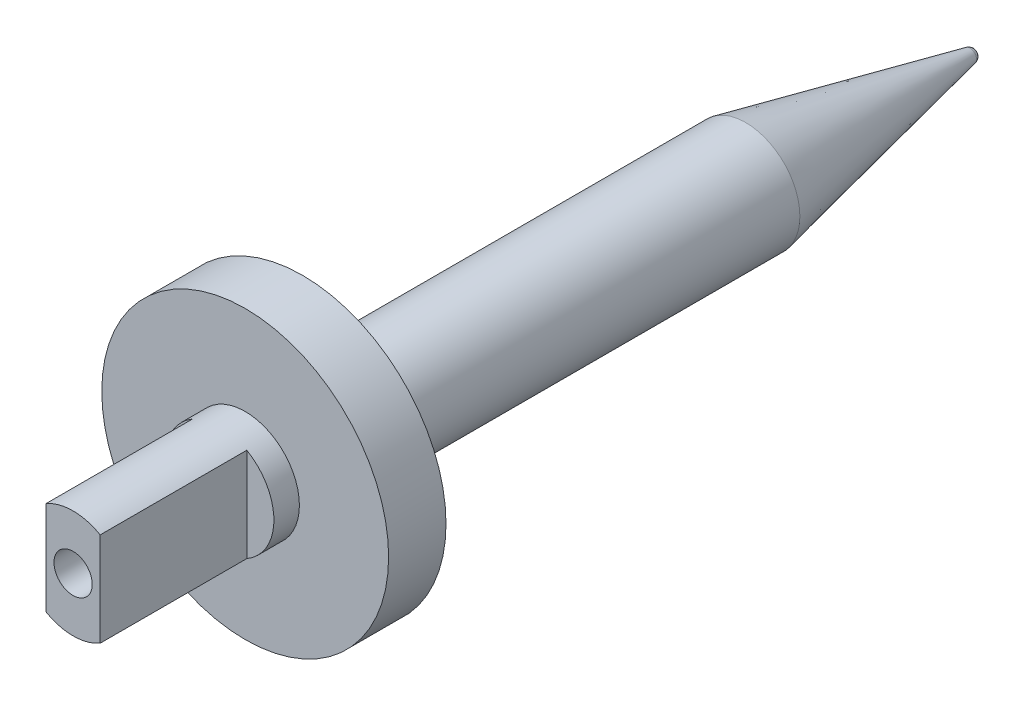
ISO-10303-21;
HEADER;
FILE_DESCRIPTION(('STEP AP214'),'2;1');
FILE_NAME('part.step','',(''),(''),'','','');
FILE_SCHEMA(('AUTOMOTIVE_DESIGN { 1 0 10303 214 1 1 1 1 }'));
ENDSEC;
DATA;
#1=APPLICATION_CONTEXT('core data for automotive mechanical design processes');
#2=APPLICATION_PROTOCOL_DEFINITION('international standard','automotive_design',2000,#1);
#3=PRODUCT_CONTEXT('',#1,'mechanical');
#4=PRODUCT('Part','Part','',(#3));
#5=PRODUCT_RELATED_PRODUCT_CATEGORY('part','',(#4));
#6=PRODUCT_DEFINITION_FORMATION('','',#4);
#7=PRODUCT_DEFINITION_CONTEXT('part definition',#1,'design');
#8=PRODUCT_DEFINITION('design','',#6,#7);
#9=PRODUCT_DEFINITION_SHAPE('','',#8);
#10=(LENGTH_UNIT() NAMED_UNIT(*) SI_UNIT(.MILLI.,.METRE.));
#11=(NAMED_UNIT(*) PLANE_ANGLE_UNIT() SI_UNIT($,.RADIAN.));
#12=(NAMED_UNIT(*) SI_UNIT($,.STERADIAN.) SOLID_ANGLE_UNIT());
#13=UNCERTAINTY_MEASURE_WITH_UNIT(LENGTH_MEASURE(1.E-05),#10,'distance_accuracy_value','');
#14=(GEOMETRIC_REPRESENTATION_CONTEXT(3) GLOBAL_UNCERTAINTY_ASSIGNED_CONTEXT((#13)) GLOBAL_UNIT_ASSIGNED_CONTEXT((#10,
#11,#12)) REPRESENTATION_CONTEXT('',''));
#15=CARTESIAN_POINT('',(0.,0.,0.));
#16=DIRECTION('',(0.,0.,1.));
#17=DIRECTION('',(1.,0.,0.));
#18=AXIS2_PLACEMENT_3D('',#15,#16,#17);
#19=CARTESIAN_POINT('',(0.,0.,8.5));
#20=DIRECTION('',(0.,0.,1.));
#21=DIRECTION('',(1.,0.,0.));
#22=AXIS2_PLACEMENT_3D('',#19,#20,#21);
#23=PLANE('',#22);
#24=CARTESIAN_POINT('',(0.,0.,8.5));
#25=DIRECTION('',(0.,0.,1.));
#26=DIRECTION('',(1.,0.,0.));
#27=AXIS2_PLACEMENT_3D('',#24,#25,#26);
#28=CIRCLE('',#27,8.5);
#29=CARTESIAN_POINT('',(-4.25,7.36121593216773,8.5));
#30=VERTEX_POINT('',#29);
#31=CARTESIAN_POINT('',(-4.25,-7.36121593216773,8.5));
#32=VERTEX_POINT('',#31);
#33=EDGE_CURVE('E79',#30,#32,#28,.T.);
#34=ORIENTED_EDGE('',*,*,#33,.T.);
#35=DIRECTION('',(0.,1.,0.));
#36=VECTOR('',#35,1.);
#37=CARTESIAN_POINT('',(-4.24999999999999,-49.6414213562373,8.5));
#38=LINE('',#37,#36);
#39=EDGE_CURVE('E121',#32,#30,#38,.T.);
#40=ORIENTED_EDGE('',*,*,#39,.T.);
#41=EDGE_LOOP('',(#34,#40));
#42=FACE_BOUND('',#41,.T.);
#43=ADVANCED_FACE('F51',(#42),#23,.T.);
#44=CARTESIAN_POINT('',(0.,-49.6414213562373,4.5));
#45=DIRECTION('',(0.,0.,1.));
#46=DIRECTION('',(1.,0.,0.));
#47=AXIS2_PLACEMENT_3D('',#44,#45,#46);
#48=PLANE('',#47);
#49=CARTESIAN_POINT('',(0.,0.,4.5));
#50=DIRECTION('',(0.,0.,1.));
#51=DIRECTION('',(1.,0.,0.));
#52=AXIS2_PLACEMENT_3D('',#49,#50,#51);
#53=CIRCLE('',#52,22.5);
#54=CARTESIAN_POINT('',(22.5,0.,4.5));
#55=VERTEX_POINT('',#54);
#56=EDGE_CURVE('E196',#55,#55,#53,.T.);
#57=ORIENTED_EDGE('',*,*,#56,.T.);
#58=EDGE_LOOP('',(#57));
#59=FACE_BOUND('',#58,.T.);
#60=CARTESIAN_POINT('',(0.,0.,4.5));
#61=DIRECTION('',(0.,0.,1.));
#62=DIRECTION('',(1.,0.,0.));
#63=AXIS2_PLACEMENT_3D('',#60,#61,#62);
#64=CIRCLE('',#63,8.5);
#65=CARTESIAN_POINT('',(8.5,0.,4.5));
#66=VERTEX_POINT('',#65);
#67=EDGE_CURVE('E160',#66,#66,#64,.T.);
#68=ORIENTED_EDGE('',*,*,#67,.F.);
#69=EDGE_LOOP('',(#68));
#70=FACE_BOUND('',#69,.T.);
#71=ADVANCED_FACE('F206',(#59,#70),#48,.T.);
#72=CARTESIAN_POINT('',(0.,0.,-110.));
#73=DIRECTION('',(0.,0.,1.));
#74=DIRECTION('',(1.,0.,0.));
#75=AXIS2_PLACEMENT_3D('',#72,#73,#74);
#76=CYLINDRICAL_SURFACE('',#75,8.5);
#77=CARTESIAN_POINT('',(0.,0.,-4.5));
#78=DIRECTION('',(0.,0.,1.));
#79=DIRECTION('',(1.,0.,0.));
#80=AXIS2_PLACEMENT_3D('',#77,#78,#79);
#81=CIRCLE('',#80,8.5);
#82=CARTESIAN_POINT('',(8.5,0.,-4.5));
#83=VERTEX_POINT('',#82);
#84=EDGE_CURVE('E193',#83,#83,#81,.F.);
#85=ORIENTED_EDGE('',*,*,#84,.T.);
#86=EDGE_LOOP('',(#85));
#87=FACE_BOUND('',#86,.T.);
#88=CARTESIAN_POINT('',(0.,0.,-74.0106440694332));
#89=DIRECTION('',(0.,0.,1.));
#90=DIRECTION('',(1.,0.,0.));
#91=AXIS2_PLACEMENT_3D('',#88,#89,#90);
#92=CIRCLE('',#91,8.5);
#93=CARTESIAN_POINT('',(8.5,0.,-74.0106440694332));
#94=VERTEX_POINT('',#93);
#95=EDGE_CURVE('E182',#94,#94,#92,.T.);
#96=ORIENTED_EDGE('',*,*,#95,.T.);
#97=EDGE_LOOP('',(#96));
#98=FACE_BOUND('',#97,.T.);
#99=ADVANCED_FACE('F208',(#87,#98),#76,.T.);
#100=CARTESIAN_POINT('',(0.,0.,4.5));
#101=DIRECTION('',(0.,0.,-1.));
#102=DIRECTION('',(-1.,0.,0.));
#103=AXIS2_PLACEMENT_3D('',#100,#101,#102);
#104=CYLINDRICAL_SURFACE('',#103,22.5);
#105=ORIENTED_EDGE('',*,*,#56,.F.);
#106=EDGE_LOOP('',(#105));
#107=FACE_BOUND('',#106,.T.);
#108=CARTESIAN_POINT('',(0.,0.,-4.5));
#109=DIRECTION('',(0.,0.,1.));
#110=DIRECTION('',(1.,0.,0.));
#111=AXIS2_PLACEMENT_3D('',#108,#109,#110);
#112=CIRCLE('',#111,22.5);
#113=CARTESIAN_POINT('',(22.5,0.,-4.5));
#114=VERTEX_POINT('',#113);
#115=EDGE_CURVE('E185',#114,#114,#112,.T.);
#116=ORIENTED_EDGE('',*,*,#115,.T.);
#117=EDGE_LOOP('',(#116));
#118=FACE_BOUND('',#117,.T.);
#119=ADVANCED_FACE('F215',(#107,#118),#104,.T.);
#120=CARTESIAN_POINT('',(0.,-49.6414213562373,-4.5));
#121=DIRECTION('',(0.,0.,1.));
#122=DIRECTION('',(1.,0.,0.));
#123=AXIS2_PLACEMENT_3D('',#120,#121,#122);
#124=PLANE('',#123);
#125=ORIENTED_EDGE('',*,*,#84,.F.);
#126=EDGE_LOOP('',(#125));
#127=FACE_BOUND('',#126,.T.);
#128=ORIENTED_EDGE('',*,*,#115,.F.);
#129=EDGE_LOOP('',(#128));
#130=FACE_BOUND('',#129,.T.);
#131=ADVANCED_FACE('F224',(#127,#130),#124,.F.);
#132=CARTESIAN_POINT('',(0.,0.,-74.0106440694332));
#133=DIRECTION('',(0.,0.,1.));
#134=DIRECTION('',(1.,0.,0.));
#135=AXIS2_PLACEMENT_3D('',#132,#133,#134);
#136=CONICAL_SURFACE('',#135,8.5,0.20943951023932);
#137=CARTESIAN_POINT('',(0.,0.,-109.207911690818));
#138=DIRECTION('',(0.,0.,1.));
#139=DIRECTION('',(1.,0.,0.));
#140=AXIS2_PLACEMENT_3D('',#137,#138,#139);
#141=CIRCLE('',#140,1.01858981421889);
#142=CARTESIAN_POINT('',(1.01858981421889,0.,-109.207911690818));
#143=VERTEX_POINT('',#142);
#144=EDGE_CURVE('E61',#143,#143,#141,.T.);
#145=ORIENTED_EDGE('',*,*,#144,.T.);
#146=EDGE_LOOP('',(#145));
#147=FACE_BOUND('',#146,.T.);
#148=ORIENTED_EDGE('',*,*,#95,.F.);
#149=EDGE_LOOP('',(#148));
#150=FACE_BOUND('',#149,.T.);
#151=ADVANCED_FACE('F222',(#147,#150),#136,.T.);
#152=CARTESIAN_POINT('',(0.,0.,-110.));
#153=DIRECTION('',(0.,0.,1.));
#154=DIRECTION('',(1.,0.,0.));
#155=AXIS2_PLACEMENT_3D('',#152,#153,#154);
#156=PLANE('',#155);
#157=CARTESIAN_POINT('',(0.,0.,-110.));
#158=DIRECTION('',(0.,0.,1.));
#159=DIRECTION('',(1.,0.,0.));
#160=AXIS2_PLACEMENT_3D('',#157,#158,#159);
#161=CIRCLE('',#160,0.0404422134850855);
#162=CARTESIAN_POINT('',(0.0404422134850855,0.,-110.));
#163=VERTEX_POINT('',#162);
#164=EDGE_CURVE('E11',#163,#163,#161,.F.);
#165=ORIENTED_EDGE('',*,*,#164,.T.);
#166=EDGE_LOOP('',(#165));
#167=FACE_BOUND('',#166,.T.);
#168=ADVANCED_FACE('F230',(#167),#156,.F.);
#169=CARTESIAN_POINT('',(0.,0.,-109.));
#170=DIRECTION('',(0.,0.,1.));
#171=DIRECTION('',(1.,0.,0.));
#172=AXIS2_PLACEMENT_3D('',#169,#170,#171);
#173=DEGENERATE_TOROIDAL_SURFACE('',#172,0.0404422134850855,1.,.T.);
#174=ORIENTED_EDGE('',*,*,#164,.F.);
#175=EDGE_LOOP('',(#174));
#176=FACE_BOUND('',#175,.T.);
#177=ORIENTED_EDGE('',*,*,#144,.F.);
#178=EDGE_LOOP('',(#177));
#179=FACE_BOUND('',#178,.T.);
#180=ADVANCED_FACE('F53',(#176,#179),#173,.T.);
#181=CARTESIAN_POINT('',(0.,0.,8.5));
#182=DIRECTION('',(0.,0.,-1.));
#183=DIRECTION('',(-1.,0.,0.));
#184=AXIS2_PLACEMENT_3D('',#181,#182,#183);
#185=CYLINDRICAL_SURFACE('',#184,8.5);
#186=ORIENTED_EDGE('',*,*,#33,.F.);
#187=DIRECTION('',(0.,0.,-1.));
#188=VECTOR('',#187,1.);
#189=CARTESIAN_POINT('',(-4.25,7.36121593216773,31.5));
#190=LINE('',#189,#188);
#191=CARTESIAN_POINT('',(-4.25,7.36121593216773,31.5));
#192=VERTEX_POINT('',#191);
#193=EDGE_CURVE('E154',#192,#30,#190,.T.);
#194=ORIENTED_EDGE('',*,*,#193,.F.);
#195=CARTESIAN_POINT('',(0.,0.,31.5));
#196=DIRECTION('',(0.,0.,1.));
#197=DIRECTION('',(1.,0.,0.));
#198=AXIS2_PLACEMENT_3D('',#195,#196,#197);
#199=CIRCLE('',#198,8.5);
#200=CARTESIAN_POINT('',(4.25,7.36121593216773,31.5));
#201=VERTEX_POINT('',#200);
#202=EDGE_CURVE('E132',#201,#192,#199,.T.);
#203=ORIENTED_EDGE('',*,*,#202,.F.);
#204=DIRECTION('',(0.,0.,-1.));
#205=VECTOR('',#204,1.);
#206=CARTESIAN_POINT('',(4.25,7.36121593216773,31.5));
#207=LINE('',#206,#205);
#208=CARTESIAN_POINT('',(4.25,7.36121593216773,8.5));
#209=VERTEX_POINT('',#208);
#210=EDGE_CURVE('E149',#201,#209,#207,.T.);
#211=ORIENTED_EDGE('',*,*,#210,.T.);
#212=CARTESIAN_POINT('',(4.25000000000001,-7.36121593216772,8.5));
#213=VERTEX_POINT('',#212);
#214=EDGE_CURVE('E146',#213,#209,#28,.T.);
#215=ORIENTED_EDGE('',*,*,#214,.F.);
#216=DIRECTION('',(0.,0.,-1.));
#217=VECTOR('',#216,1.);
#218=CARTESIAN_POINT('',(4.25000000000001,-7.36121593216772,31.5));
#219=LINE('',#218,#217);
#220=CARTESIAN_POINT('',(4.25000000000001,-7.36121593216772,31.5));
#221=VERTEX_POINT('',#220);
#222=EDGE_CURVE('E153',#221,#213,#219,.T.);
#223=ORIENTED_EDGE('',*,*,#222,.F.);
#224=CARTESIAN_POINT('',(-4.25,-7.36121593216773,31.5));
#225=VERTEX_POINT('',#224);
#226=EDGE_CURVE('E127',#225,#221,#199,.T.);
#227=ORIENTED_EDGE('',*,*,#226,.F.);
#228=DIRECTION('',(0.,0.,-1.));
#229=VECTOR('',#228,1.);
#230=CARTESIAN_POINT('',(-4.25,-7.36121593216773,31.5));
#231=LINE('',#230,#229);
#232=EDGE_CURVE('E139',#225,#32,#231,.T.);
#233=ORIENTED_EDGE('',*,*,#232,.T.);
#234=EDGE_LOOP('',(#186,#194,#203,#211,#215,#223,#227,#233));
#235=FACE_BOUND('',#234,.T.);
#236=ORIENTED_EDGE('',*,*,#67,.T.);
#237=EDGE_LOOP('',(#236));
#238=FACE_BOUND('',#237,.T.);
#239=ADVANCED_FACE('F179',(#235,#238),#185,.T.);
#240=DIRECTION('',(0.,1.,0.));
#241=VECTOR('',#240,1.);
#242=CARTESIAN_POINT('',(4.25000000000001,-49.6414213562373,8.5));
#243=LINE('',#242,#241);
#244=EDGE_CURVE('E71',#213,#209,#243,.T.);
#245=ORIENTED_EDGE('',*,*,#244,.F.);
#246=ORIENTED_EDGE('',*,*,#214,.T.);
#247=EDGE_LOOP('',(#245,#246));
#248=FACE_BOUND('',#247,.T.);
#249=ADVANCED_FACE('F219',(#248),#23,.T.);
#250=CARTESIAN_POINT('',(4.25000000000001,-49.6414213562373,31.5));
#251=DIRECTION('',(-1.,0.,0.));
#252=DIRECTION('',(0.,-1.,0.));
#253=AXIS2_PLACEMENT_3D('',#250,#251,#252);
#254=PLANE('',#253);
#255=ORIENTED_EDGE('',*,*,#244,.T.);
#256=ORIENTED_EDGE('',*,*,#210,.F.);
#257=DIRECTION('',(0.,1.,0.));
#258=VECTOR('',#257,1.);
#259=CARTESIAN_POINT('',(4.25000000000001,-49.6414213562373,31.5));
#260=LINE('',#259,#258);
#261=EDGE_CURVE('E131',#221,#201,#260,.T.);
#262=ORIENTED_EDGE('',*,*,#261,.F.);
#263=ORIENTED_EDGE('',*,*,#222,.T.);
#264=EDGE_LOOP('',(#255,#256,#262,#263));
#265=FACE_BOUND('',#264,.T.);
#266=ADVANCED_FACE('F252',(#265),#254,.F.);
#267=CARTESIAN_POINT('',(-4.24999999999999,-49.6414213562373,31.5));
#268=DIRECTION('',(-1.,0.,0.));
#269=DIRECTION('',(0.,-1.,0.));
#270=AXIS2_PLACEMENT_3D('',#267,#268,#269);
#271=PLANE('',#270);
#272=ORIENTED_EDGE('',*,*,#39,.F.);
#273=ORIENTED_EDGE('',*,*,#232,.F.);
#274=DIRECTION('',(0.,1.,0.));
#275=VECTOR('',#274,1.);
#276=CARTESIAN_POINT('',(-4.24999999999999,-49.6414213562373,31.5));
#277=LINE('',#276,#275);
#278=EDGE_CURVE('E135',#225,#192,#277,.T.);
#279=ORIENTED_EDGE('',*,*,#278,.T.);
#280=ORIENTED_EDGE('',*,*,#193,.T.);
#281=EDGE_LOOP('',(#272,#273,#279,#280));
#282=FACE_BOUND('',#281,.T.);
#283=ADVANCED_FACE('F175',(#282),#271,.T.);
#284=CARTESIAN_POINT('',(0.,-49.6414213562373,31.5));
#285=DIRECTION('',(0.,0.,1.));
#286=DIRECTION('',(1.,0.,0.));
#287=AXIS2_PLACEMENT_3D('',#284,#285,#286);
#288=PLANE('',#287);
#289=CARTESIAN_POINT('',(0.,0.,31.5));
#290=DIRECTION('',(0.,0.,1.));
#291=DIRECTION('',(1.,0.,0.));
#292=AXIS2_PLACEMENT_3D('',#289,#290,#291);
#293=CIRCLE('',#292,3.);
#294=CARTESIAN_POINT('',(3.,0.,31.5));
#295=VERTEX_POINT('',#294);
#296=EDGE_CURVE('E116',#295,#295,#293,.T.);
#297=ORIENTED_EDGE('',*,*,#296,.F.);
#298=EDGE_LOOP('',(#297));
#299=FACE_BOUND('',#298,.T.);
#300=ORIENTED_EDGE('',*,*,#226,.T.);
#301=ORIENTED_EDGE('',*,*,#261,.T.);
#302=ORIENTED_EDGE('',*,*,#202,.T.);
#303=ORIENTED_EDGE('',*,*,#278,.F.);
#304=EDGE_LOOP('',(#300,#301,#302,#303));
#305=FACE_BOUND('',#304,.T.);
#306=ADVANCED_FACE('F109',(#299,#305),#288,.T.);
#307=CARTESIAN_POINT('',(0.,0.,12.5));
#308=DIRECTION('',(0.,0.,1.));
#309=DIRECTION('',(1.,0.,0.));
#310=AXIS2_PLACEMENT_3D('',#307,#308,#309);
#311=CONICAL_SURFACE('',#310,3.,1.02974425867665);
#312=CARTESIAN_POINT('',(0.,0.,10.6974181429173));
#313=VERTEX_POINT('',#312);
#314=VERTEX_LOOP('',#313);
#315=FACE_BOUND('',#314,.T.);
#316=CARTESIAN_POINT('',(0.,0.,12.5));
#317=DIRECTION('',(0.,0.,1.));
#318=DIRECTION('',(1.,0.,0.));
#319=AXIS2_PLACEMENT_3D('',#316,#317,#318);
#320=CIRCLE('',#319,3.);
#321=CARTESIAN_POINT('',(3.,0.,12.5));
#322=VERTEX_POINT('',#321);
#323=EDGE_CURVE('E113',#322,#322,#320,.T.);
#324=ORIENTED_EDGE('',*,*,#323,.T.);
#325=EDGE_LOOP('',(#324));
#326=FACE_BOUND('',#325,.T.);
#327=ADVANCED_FACE('F105',(#315,#326),#311,.F.);
#328=CARTESIAN_POINT('',(0.,0.,31.5));
#329=DIRECTION('',(0.,0.,1.));
#330=DIRECTION('',(1.,0.,0.));
#331=AXIS2_PLACEMENT_3D('',#328,#329,#330);
#332=CYLINDRICAL_SURFACE('',#331,3.);
#333=ORIENTED_EDGE('',*,*,#323,.F.);
#334=EDGE_LOOP('',(#333));
#335=FACE_BOUND('',#334,.T.);
#336=ORIENTED_EDGE('',*,*,#296,.T.);
#337=EDGE_LOOP('',(#336));
#338=FACE_BOUND('',#337,.T.);
#339=ADVANCED_FACE('F108',(#335,#338),#332,.F.);
#340=CLOSED_SHELL('',(#43,#71,#99,#119,#131,#151,#168,#180,#239,#249,#266,#283,#306,#327,#339));
#341=MANIFOLD_SOLID_BREP('B2',#340);
#342=ADVANCED_BREP_SHAPE_REPRESENTATION('',(#18,#341),#14);
#343=SHAPE_DEFINITION_REPRESENTATION(#9,#342);
ENDSEC;
END-ISO-10303-21;
